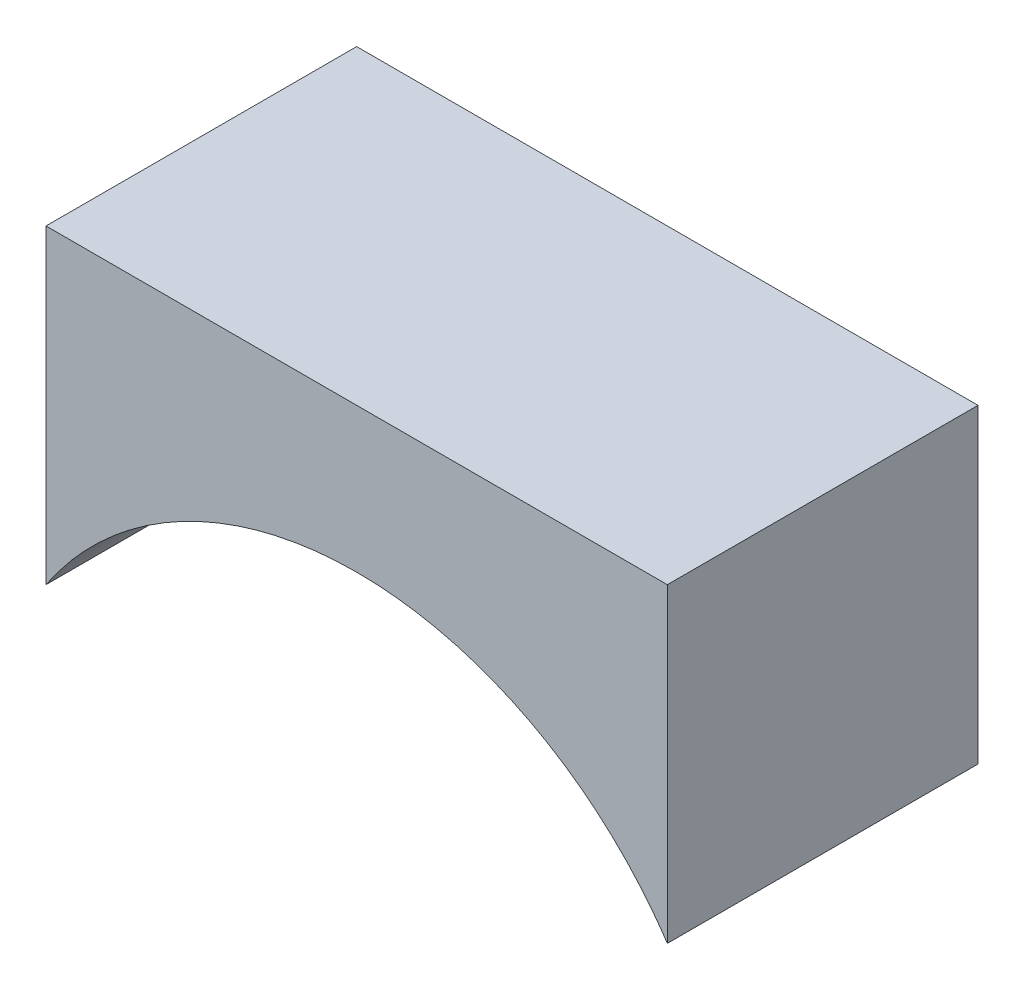
ISO-10303-21;
HEADER;
FILE_DESCRIPTION(('STEP AP214'),'2;1');
FILE_NAME('part.step','',(''),(''),'','','');
FILE_SCHEMA(('AUTOMOTIVE_DESIGN { 1 0 10303 214 1 1 1 1 }'));
ENDSEC;
DATA;
#1=APPLICATION_CONTEXT('core data for automotive mechanical design processes');
#2=APPLICATION_PROTOCOL_DEFINITION('international standard','automotive_design',2000,#1);
#3=PRODUCT_CONTEXT('',#1,'mechanical');
#4=PRODUCT('Part','Part','',(#3));
#5=PRODUCT_RELATED_PRODUCT_CATEGORY('part','',(#4));
#6=PRODUCT_DEFINITION_FORMATION('','',#4);
#7=PRODUCT_DEFINITION_CONTEXT('part definition',#1,'design');
#8=PRODUCT_DEFINITION('design','',#6,#7);
#9=PRODUCT_DEFINITION_SHAPE('','',#8);
#10=(LENGTH_UNIT() NAMED_UNIT(*) SI_UNIT(.MILLI.,.METRE.));
#11=(NAMED_UNIT(*) PLANE_ANGLE_UNIT() SI_UNIT($,.RADIAN.));
#12=(NAMED_UNIT(*) SI_UNIT($,.STERADIAN.) SOLID_ANGLE_UNIT());
#13=UNCERTAINTY_MEASURE_WITH_UNIT(LENGTH_MEASURE(1.E-05),#10,'distance_accuracy_value','');
#14=(GEOMETRIC_REPRESENTATION_CONTEXT(3) GLOBAL_UNCERTAINTY_ASSIGNED_CONTEXT((#13)) GLOBAL_UNIT_ASSIGNED_CONTEXT((#10,
#11,#12)) REPRESENTATION_CONTEXT('',''));
#15=CARTESIAN_POINT('',(0.,0.,0.));
#16=DIRECTION('',(0.,0.,1.));
#17=DIRECTION('',(1.,0.,0.));
#18=AXIS2_PLACEMENT_3D('',#15,#16,#17);
#19=CARTESIAN_POINT('',(1524.5052428421,-601.887687800648,-150.));
#20=CARTESIAN_POINT('',(1512.82219181726,-600.21053433742,-150.));
#21=CARTESIAN_POINT('',(1489.78646016404,-594.554867229104,-150.));
#22=CARTESIAN_POINT('',(1457.55184924692,-579.493302193902,-150.));
#23=CARTESIAN_POINT('',(1428.87498291266,-558.432480283654,-150.));
#24=CARTESIAN_POINT('',(1404.85789705233,-532.181757073325,-150.));
#25=CARTESIAN_POINT('',(1386.42355480659,-501.749933134312,-150.));
#26=CARTESIAN_POINT('',(1374.28037760986,-468.30648639423,-150.));
#27=CARTESIAN_POINT('',(1368.89502095182,-433.136629755997,-150.));
#28=CARTESIAN_POINT('',(1370.47444106871,-397.591921086738,-150.));
#29=CARTESIAN_POINT('',(1378.95794173119,-363.038323606911,-150.));
#30=CARTESIAN_POINT('',(1394.01950676639,-330.803712689784,-150.));
#31=CARTESIAN_POINT('',(1415.08032867664,-302.126846355526,-150.));
#32=CARTESIAN_POINT('',(1441.33105188696,-278.109760495188,-150.));
#33=CARTESIAN_POINT('',(1471.76287582597,-259.675418249449,-150.));
#34=CARTESIAN_POINT('',(1505.20632256605,-247.532241052711,-150.));
#35=CARTESIAN_POINT('',(1540.37617920428,-242.146884394676,-150.));
#36=CARTESIAN_POINT('',(1575.92088787354,-243.726304511566,-150.));
#37=CARTESIAN_POINT('',(1610.47448535336,-252.209805174041,-150.));
#38=CARTESIAN_POINT('',(1642.70909627048,-267.271370209242,-150.));
#39=CARTESIAN_POINT('',(1671.38596260474,-288.33219211949,-150.));
#40=CARTESIAN_POINT('',(1695.40304846507,-314.58291532982,-150.));
#41=CARTESIAN_POINT('',(1713.83739071081,-345.014739268832,-150.));
#42=CARTESIAN_POINT('',(1725.98056790754,-378.458186008915,-150.));
#43=CARTESIAN_POINT('',(1731.36592456558,-413.628042647148,-150.));
#44=CARTESIAN_POINT('',(1729.78650444869,-449.172751316407,-150.));
#45=CARTESIAN_POINT('',(1721.30300378621,-483.726348796234,-150.));
#46=CARTESIAN_POINT('',(1706.24143875101,-515.96095971336,-150.));
#47=CARTESIAN_POINT('',(1685.18061684077,-544.637826047619,-150.));
#48=CARTESIAN_POINT('',(1658.92989363044,-568.654911907956,-150.));
#49=CARTESIAN_POINT('',(1628.49806969143,-587.089254153696,-150.));
#50=CARTESIAN_POINT('',(1595.05462295135,-599.232431350433,-150.));
#51=CARTESIAN_POINT('',(1559.88476631312,-604.617788008469,-150.));
#52=CARTESIAN_POINT('',(1536.18829386695,-603.564841263875,-150.));
#53=CARTESIAN_POINT('',(1524.5052428421,-601.887687800648,-150.));
#54=B_SPLINE_CURVE_WITH_KNOTS('',3,(#19,#20,#21,#22,#23,#24,#25,#26,#27,#28,#29,#30,#31,#32,#33,
#34,#35,#36,#37,#38,#39,#40,#41,#42,#43,#44,#45,#46,#47,#48,#49,#50,#51,#52,#53),.UNSPECIFIED.,
.T.,.F.,(4,1,1,1,1,1,1,1,1,1,1,1,1,1,1,1,1,1,1,1,1,1,1,1,1,1,1,1,1,1,1,1,4),(0.,
0.196349540849362,0.392699081698725,0.589048622548086,0.785398163397448,0.981747704246811,
1.17809724509617,1.37444678594553,1.5707963267949,1.76714586764426,1.96349540849362,
2.15984494934298,2.35619449019234,2.55254403104171,2.74889357189107,2.94524311274043,
3.14159265358979,3.33794219443916,3.53429173528852,3.73064127613788,3.92699081698724,
4.1233403578366,4.31968989868597,4.51603943953533,4.71238898038469,4.90873852123405,
5.10508806208341,5.30143760293278,5.49778714378214,5.6941366846315,5.89048622548086,
6.08683576633022,6.28318530717959),.UNSPECIFIED.);
#55=DIRECTION('',(0.,0.,1.));
#56=VECTOR('',#55,1.);
#57=SURFACE_OF_LINEAR_EXTRUSION('',#54,#56);
#58=CARTESIAN_POINT('',(1524.5052428421,-601.887687800648,0.));
#59=CARTESIAN_POINT('',(1512.82219181726,-600.21053433742,0.));
#60=CARTESIAN_POINT('',(1489.78646016404,-594.554867229104,0.));
#61=CARTESIAN_POINT('',(1457.55184924692,-579.493302193902,0.));
#62=CARTESIAN_POINT('',(1428.87498291266,-558.432480283654,0.));
#63=CARTESIAN_POINT('',(1404.85789705233,-532.181757073325,0.));
#64=CARTESIAN_POINT('',(1386.42355480659,-501.749933134312,0.));
#65=CARTESIAN_POINT('',(1374.28037760986,-468.30648639423,0.));
#66=CARTESIAN_POINT('',(1368.89502095182,-433.136629755997,0.));
#67=CARTESIAN_POINT('',(1370.47444106871,-397.591921086738,0.));
#68=CARTESIAN_POINT('',(1378.95794173119,-363.038323606911,0.));
#69=CARTESIAN_POINT('',(1394.01950676639,-330.803712689784,0.));
#70=CARTESIAN_POINT('',(1415.08032867664,-302.126846355526,0.));
#71=CARTESIAN_POINT('',(1441.33105188696,-278.109760495188,0.));
#72=CARTESIAN_POINT('',(1471.76287582597,-259.675418249449,0.));
#73=CARTESIAN_POINT('',(1505.20632256605,-247.532241052711,0.));
#74=CARTESIAN_POINT('',(1540.37617920428,-242.146884394676,0.));
#75=CARTESIAN_POINT('',(1575.92088787354,-243.726304511566,0.));
#76=CARTESIAN_POINT('',(1610.47448535336,-252.209805174041,0.));
#77=CARTESIAN_POINT('',(1642.70909627048,-267.271370209242,0.));
#78=CARTESIAN_POINT('',(1671.38596260474,-288.33219211949,0.));
#79=CARTESIAN_POINT('',(1695.40304846507,-314.58291532982,0.));
#80=CARTESIAN_POINT('',(1713.83739071081,-345.014739268832,0.));
#81=CARTESIAN_POINT('',(1725.98056790754,-378.458186008915,0.));
#82=CARTESIAN_POINT('',(1731.36592456558,-413.628042647148,0.));
#83=CARTESIAN_POINT('',(1729.78650444869,-449.172751316407,0.));
#84=CARTESIAN_POINT('',(1721.30300378621,-483.726348796234,0.));
#85=CARTESIAN_POINT('',(1706.24143875101,-515.96095971336,0.));
#86=CARTESIAN_POINT('',(1685.18061684077,-544.637826047619,0.));
#87=CARTESIAN_POINT('',(1658.92989363044,-568.654911907956,0.));
#88=CARTESIAN_POINT('',(1628.49806969143,-587.089254153696,0.));
#89=CARTESIAN_POINT('',(1595.05462295135,-599.232431350433,0.));
#90=CARTESIAN_POINT('',(1559.88476631312,-604.617788008469,0.));
#91=CARTESIAN_POINT('',(1536.18829386695,-603.564841263875,0.));
#92=CARTESIAN_POINT('',(1524.5052428421,-601.887687800648,0.));
#93=B_SPLINE_CURVE_WITH_KNOTS('',3,(#58,#59,#60,#61,#62,#63,#64,#65,#66,#67,#68,#69,#70,#71,#72,
#73,#74,#75,#76,#77,#78,#79,#80,#81,#82,#83,#84,#85,#86,#87,#88,#89,#90,#91,#92),.UNSPECIFIED.,
.T.,.F.,(4,1,1,1,1,1,1,1,1,1,1,1,1,1,1,1,1,1,1,1,1,1,1,1,1,1,1,1,1,1,1,1,4),(0.,
0.196349540849362,0.392699081698725,0.589048622548086,0.785398163397448,0.981747704246811,
1.17809724509617,1.37444678594553,1.5707963267949,1.76714586764426,1.96349540849362,
2.15984494934298,2.35619449019234,2.55254403104171,2.74889357189107,2.94524311274043,
3.14159265358979,3.33794219443916,3.53429173528852,3.73064127613788,3.92699081698724,
4.1233403578366,4.31968989868597,4.51603943953533,4.71238898038469,4.90873852123405,
5.10508806208341,5.30143760293278,5.49778714378214,5.6941366846315,5.89048622548086,
6.08683576633022,6.28318530717959),.UNSPECIFIED.);
#94=CARTESIAN_POINT('',(1400.13046567733,-323.279128227412,0.));
#95=VERTEX_POINT('',#94);
#96=CARTESIAN_POINT('',(1700.13046567733,-323.279128227412,0.));
#97=VERTEX_POINT('',#96);
#98=EDGE_CURVE('E106',#95,#97,#93,.T.);
#99=ORIENTED_EDGE('',*,*,#98,.F.);
#100=DIRECTION('',(0.,0.,1.));
#101=VECTOR('',#100,1.);
#102=CARTESIAN_POINT('',(1400.13046567733,-323.279128227412,-150.));
#103=LINE('',#102,#101);
#104=CARTESIAN_POINT('',(1400.13046567733,-323.279128227412,-150.));
#105=VERTEX_POINT('',#104);
#106=EDGE_CURVE('E11',#105,#95,#103,.T.);
#107=ORIENTED_EDGE('',*,*,#106,.F.);
#108=CARTESIAN_POINT('',(1700.13046567733,-323.279128227412,-150.));
#109=VERTEX_POINT('',#108);
#110=EDGE_CURVE('E98',#105,#109,#54,.T.);
#111=ORIENTED_EDGE('',*,*,#110,.T.);
#112=DIRECTION('',(0.,0.,1.));
#113=VECTOR('',#112,1.);
#114=CARTESIAN_POINT('',(1700.13046567733,-323.279128227412,-150.));
#115=LINE('',#114,#113);
#116=EDGE_CURVE('E43',#109,#97,#115,.T.);
#117=ORIENTED_EDGE('',*,*,#116,.T.);
#118=EDGE_LOOP('',(#99,#107,#111,#117));
#119=FACE_BOUND('',#118,.T.);
#120=ADVANCED_FACE('F39',(#119),#57,.T.);
#121=CARTESIAN_POINT('',(1400.13046567733,-323.279128227412,-150.));
#122=DIRECTION('',(-1.,0.,0.));
#123=DIRECTION('',(0.,-1.,0.));
#124=AXIS2_PLACEMENT_3D('',#121,#122,#123);
#125=PLANE('',#124);
#126=DIRECTION('',(0.,-1.,0.));
#127=VECTOR('',#126,1.);
#128=CARTESIAN_POINT('',(1400.13046567733,-323.279128227412,0.));
#129=LINE('',#128,#127);
#130=CARTESIAN_POINT('',(1400.13046567733,-173.279128227412,0.));
#131=VERTEX_POINT('',#130);
#132=EDGE_CURVE('E100',#131,#95,#129,.T.);
#133=ORIENTED_EDGE('',*,*,#132,.F.);
#134=DIRECTION('',(0.,0.,1.));
#135=VECTOR('',#134,1.);
#136=CARTESIAN_POINT('',(1400.13046567733,-173.279128227412,-150.));
#137=LINE('',#136,#135);
#138=CARTESIAN_POINT('',(1400.13046567733,-173.279128227412,-150.));
#139=VERTEX_POINT('',#138);
#140=EDGE_CURVE('E49',#139,#131,#137,.T.);
#141=ORIENTED_EDGE('',*,*,#140,.F.);
#142=DIRECTION('',(0.,-1.,0.));
#143=VECTOR('',#142,1.);
#144=CARTESIAN_POINT('',(1400.13046567733,-323.279128227412,-150.));
#145=LINE('',#144,#143);
#146=EDGE_CURVE('E95',#139,#105,#145,.T.);
#147=ORIENTED_EDGE('',*,*,#146,.T.);
#148=ORIENTED_EDGE('',*,*,#106,.T.);
#149=EDGE_LOOP('',(#133,#141,#147,#148));
#150=FACE_BOUND('',#149,.T.);
#151=ADVANCED_FACE('F121',(#150),#125,.T.);
#152=CARTESIAN_POINT('',(1400.13046567733,-173.279128227412,-150.));
#153=DIRECTION('',(0.,1.,0.));
#154=DIRECTION('',(0.,0.,1.));
#155=AXIS2_PLACEMENT_3D('',#152,#153,#154);
#156=PLANE('',#155);
#157=DIRECTION('',(-1.,0.,0.));
#158=VECTOR('',#157,1.);
#159=CARTESIAN_POINT('',(1400.13046567733,-173.279128227412,0.));
#160=LINE('',#159,#158);
#161=CARTESIAN_POINT('',(1700.13046567733,-173.279128227412,0.));
#162=VERTEX_POINT('',#161);
#163=EDGE_CURVE('E90',#162,#131,#160,.T.);
#164=ORIENTED_EDGE('',*,*,#163,.F.);
#165=DIRECTION('',(0.,0.,1.));
#166=VECTOR('',#165,1.);
#167=CARTESIAN_POINT('',(1700.13046567733,-173.279128227412,-150.));
#168=LINE('',#167,#166);
#169=CARTESIAN_POINT('',(1700.13046567733,-173.279128227412,-150.));
#170=VERTEX_POINT('',#169);
#171=EDGE_CURVE('E85',#170,#162,#168,.T.);
#172=ORIENTED_EDGE('',*,*,#171,.F.);
#173=DIRECTION('',(-1.,0.,0.));
#174=VECTOR('',#173,1.);
#175=CARTESIAN_POINT('',(1400.13046567733,-173.279128227412,-150.));
#176=LINE('',#175,#174);
#177=EDGE_CURVE('E88',#170,#139,#176,.T.);
#178=ORIENTED_EDGE('',*,*,#177,.T.);
#179=ORIENTED_EDGE('',*,*,#140,.T.);
#180=EDGE_LOOP('',(#164,#172,#178,#179));
#181=FACE_BOUND('',#180,.T.);
#182=ADVANCED_FACE('F87',(#181),#156,.T.);
#183=CARTESIAN_POINT('',(1700.13046567733,-323.279128227412,-150.));
#184=DIRECTION('',(1.,0.,0.));
#185=DIRECTION('',(0.,0.,-1.));
#186=AXIS2_PLACEMENT_3D('',#183,#184,#185);
#187=PLANE('',#186);
#188=DIRECTION('',(0.,1.,0.));
#189=VECTOR('',#188,1.);
#190=CARTESIAN_POINT('',(1700.13046567733,-323.279128227412,0.));
#191=LINE('',#190,#189);
#192=EDGE_CURVE('E111',#97,#162,#191,.T.);
#193=ORIENTED_EDGE('',*,*,#192,.F.);
#194=ORIENTED_EDGE('',*,*,#116,.F.);
#195=DIRECTION('',(0.,1.,0.));
#196=VECTOR('',#195,1.);
#197=CARTESIAN_POINT('',(1700.13046567733,-323.279128227412,-150.));
#198=LINE('',#197,#196);
#199=EDGE_CURVE('E94',#109,#170,#198,.T.);
#200=ORIENTED_EDGE('',*,*,#199,.T.);
#201=ORIENTED_EDGE('',*,*,#171,.T.);
#202=EDGE_LOOP('',(#193,#194,#200,#201));
#203=FACE_BOUND('',#202,.T.);
#204=ADVANCED_FACE('F97',(#203),#187,.T.);
#205=CARTESIAN_POINT('',(1575.7557026753,-244.876984602497,-150.));
#206=DIRECTION('',(0.,0.,-1.));
#207=DIRECTION('',(-1.,0.,0.));
#208=AXIS2_PLACEMENT_3D('',#205,#206,#207);
#209=PLANE('',#208);
#210=ORIENTED_EDGE('',*,*,#110,.F.);
#211=ORIENTED_EDGE('',*,*,#146,.F.);
#212=ORIENTED_EDGE('',*,*,#177,.F.);
#213=ORIENTED_EDGE('',*,*,#199,.F.);
#214=EDGE_LOOP('',(#210,#211,#212,#213));
#215=FACE_BOUND('',#214,.T.);
#216=ADVANCED_FACE('F93',(#215),#209,.T.);
#217=CARTESIAN_POINT('',(1575.7557026753,-244.876984602497,0.));
#218=DIRECTION('',(0.,0.,-1.));
#219=DIRECTION('',(-1.,0.,0.));
#220=AXIS2_PLACEMENT_3D('',#217,#218,#219);
#221=PLANE('',#220);
#222=ORIENTED_EDGE('',*,*,#98,.T.);
#223=ORIENTED_EDGE('',*,*,#192,.T.);
#224=ORIENTED_EDGE('',*,*,#163,.T.);
#225=ORIENTED_EDGE('',*,*,#132,.T.);
#226=EDGE_LOOP('',(#222,#223,#224,#225));
#227=FACE_BOUND('',#226,.T.);
#228=ADVANCED_FACE('F120',(#227),#221,.F.);
#229=CLOSED_SHELL('',(#120,#151,#182,#204,#216,#228));
#230=MANIFOLD_SOLID_BREP('B2',#229);
#231=ADVANCED_BREP_SHAPE_REPRESENTATION('',(#18,#230),#14);
#232=SHAPE_DEFINITION_REPRESENTATION(#9,#231);
ENDSEC;
END-ISO-10303-21;
